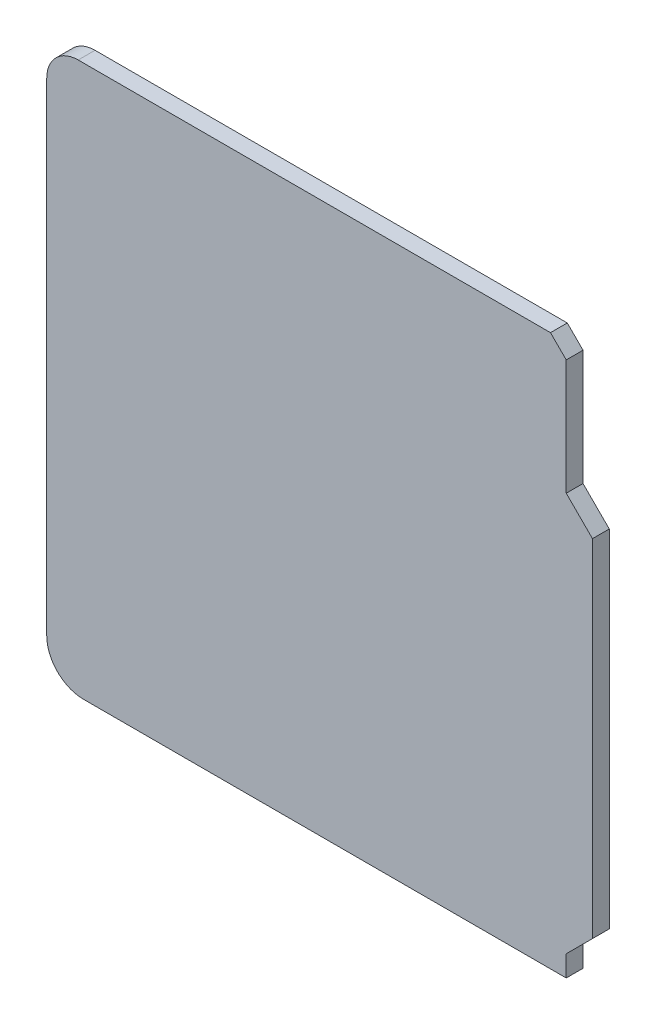
ISO-10303-21;
HEADER;
FILE_DESCRIPTION(('STEP AP214'),'2;1');
FILE_NAME('part.step','',(''),(''),'','','');
FILE_SCHEMA(('AUTOMOTIVE_DESIGN { 1 0 10303 214 1 1 1 1 }'));
ENDSEC;
DATA;
#1=APPLICATION_CONTEXT('core data for automotive mechanical design processes');
#2=APPLICATION_PROTOCOL_DEFINITION('international standard','automotive_design',2000,#1);
#3=PRODUCT_CONTEXT('',#1,'mechanical');
#4=PRODUCT('Part','Part','',(#3));
#5=PRODUCT_RELATED_PRODUCT_CATEGORY('part','',(#4));
#6=PRODUCT_DEFINITION_FORMATION('','',#4);
#7=PRODUCT_DEFINITION_CONTEXT('part definition',#1,'design');
#8=PRODUCT_DEFINITION('design','',#6,#7);
#9=PRODUCT_DEFINITION_SHAPE('','',#8);
#10=(LENGTH_UNIT() NAMED_UNIT(*) SI_UNIT(.MILLI.,.METRE.));
#11=(NAMED_UNIT(*) PLANE_ANGLE_UNIT() SI_UNIT($,.RADIAN.));
#12=(NAMED_UNIT(*) SI_UNIT($,.STERADIAN.) SOLID_ANGLE_UNIT());
#13=UNCERTAINTY_MEASURE_WITH_UNIT(LENGTH_MEASURE(1.E-05),#10,'distance_accuracy_value','');
#14=(GEOMETRIC_REPRESENTATION_CONTEXT(3) GLOBAL_UNCERTAINTY_ASSIGNED_CONTEXT((#13)) GLOBAL_UNIT_ASSIGNED_CONTEXT((#10,
#11,#12)) REPRESENTATION_CONTEXT('',''));
#15=CARTESIAN_POINT('',(0.,0.,0.));
#16=DIRECTION('',(0.,0.,1.));
#17=DIRECTION('',(1.,0.,0.));
#18=AXIS2_PLACEMENT_3D('',#15,#16,#17);
#19=CARTESIAN_POINT('',(-24.7092776223408,29.8901661766281,1.6));
#20=DIRECTION('',(0.,0.,-1.));
#21=DIRECTION('',(-1.,0.,0.));
#22=AXIS2_PLACEMENT_3D('',#19,#20,#21);
#23=CYLINDRICAL_SURFACE('',#22,3.);
#24=CARTESIAN_POINT('',(-24.7092776223408,29.8901661766281,0.));
#25=DIRECTION('',(0.,0.,1.));
#26=DIRECTION('',(1.,0.,0.));
#27=AXIS2_PLACEMENT_3D('',#24,#25,#26);
#28=CIRCLE('',#27,3.);
#29=CARTESIAN_POINT('',(-24.7092776223408,32.8901661766281,0.));
#30=VERTEX_POINT('',#29);
#31=CARTESIAN_POINT('',(-27.7092776223408,29.8901661766281,0.));
#32=VERTEX_POINT('',#31);
#33=EDGE_CURVE('E148',#30,#32,#28,.T.);
#34=ORIENTED_EDGE('',*,*,#33,.T.);
#35=DIRECTION('',(0.,0.,-1.));
#36=VECTOR('',#35,1.);
#37=CARTESIAN_POINT('',(-27.7092776223408,29.8901661766281,1.6));
#38=LINE('',#37,#36);
#39=CARTESIAN_POINT('',(-27.7092776223408,29.8901661766281,1.6));
#40=VERTEX_POINT('',#39);
#41=EDGE_CURVE('E11',#40,#32,#38,.T.);
#42=ORIENTED_EDGE('',*,*,#41,.F.);
#43=CARTESIAN_POINT('',(-24.7092776223408,29.8901661766281,1.6));
#44=DIRECTION('',(0.,0.,1.));
#45=DIRECTION('',(1.,0.,0.));
#46=AXIS2_PLACEMENT_3D('',#43,#44,#45);
#47=CIRCLE('',#46,3.);
#48=CARTESIAN_POINT('',(-24.7092776223408,32.8901661766281,1.6));
#49=VERTEX_POINT('',#48);
#50=EDGE_CURVE('E168',#49,#40,#47,.T.);
#51=ORIENTED_EDGE('',*,*,#50,.F.);
#52=DIRECTION('',(0.,0.,-1.));
#53=VECTOR('',#52,1.);
#54=CARTESIAN_POINT('',(-24.7092776223408,32.8901661766281,1.6));
#55=LINE('',#54,#53);
#56=EDGE_CURVE('E144',#49,#30,#55,.T.);
#57=ORIENTED_EDGE('',*,*,#56,.T.);
#58=EDGE_LOOP('',(#34,#42,#51,#57));
#59=FACE_BOUND('',#58,.T.);
#60=ADVANCED_FACE('F34',(#59),#23,.T.);
#61=CARTESIAN_POINT('',(-27.7092776223408,29.8901661766281,1.6));
#62=DIRECTION('',(1.,0.,0.));
#63=DIRECTION('',(0.,1.,0.));
#64=AXIS2_PLACEMENT_3D('',#61,#62,#63);
#65=PLANE('',#64);
#66=DIRECTION('',(0.,-1.,0.));
#67=VECTOR('',#66,1.);
#68=CARTESIAN_POINT('',(-27.7092776223408,29.8901661766281,0.));
#69=LINE('',#68,#67);
#70=CARTESIAN_POINT('',(-27.7092776223408,-16.1143042121438,0.));
#71=VERTEX_POINT('',#70);
#72=EDGE_CURVE('E151',#32,#71,#69,.T.);
#73=ORIENTED_EDGE('',*,*,#72,.T.);
#74=DIRECTION('',(0.,0.,-1.));
#75=VECTOR('',#74,1.);
#76=CARTESIAN_POINT('',(-27.7092776223408,-16.1143042121438,1.6));
#77=LINE('',#76,#75);
#78=CARTESIAN_POINT('',(-27.7092776223408,-16.1143042121438,1.6));
#79=VERTEX_POINT('',#78);
#80=EDGE_CURVE('E42',#79,#71,#77,.T.);
#81=ORIENTED_EDGE('',*,*,#80,.F.);
#82=DIRECTION('',(0.,-1.,0.));
#83=VECTOR('',#82,1.);
#84=CARTESIAN_POINT('',(-27.7092776223408,29.8901661766281,1.6));
#85=LINE('',#84,#83);
#86=EDGE_CURVE('E102',#40,#79,#85,.T.);
#87=ORIENTED_EDGE('',*,*,#86,.F.);
#88=ORIENTED_EDGE('',*,*,#41,.T.);
#89=EDGE_LOOP('',(#73,#81,#87,#88));
#90=FACE_BOUND('',#89,.T.);
#91=ADVANCED_FACE('F240',(#90),#65,.F.);
#92=CARTESIAN_POINT('',(-24.2092776223408,-16.1143042121438,1.6));
#93=DIRECTION('',(0.,0.,-1.));
#94=DIRECTION('',(-1.,0.,0.));
#95=AXIS2_PLACEMENT_3D('',#92,#93,#94);
#96=CYLINDRICAL_SURFACE('',#95,3.5);
#97=CARTESIAN_POINT('',(-24.2092776223408,-16.1143042121438,0.));
#98=DIRECTION('',(0.,0.,1.));
#99=DIRECTION('',(1.,0.,0.));
#100=AXIS2_PLACEMENT_3D('',#97,#98,#99);
#101=CIRCLE('',#100,3.5);
#102=CARTESIAN_POINT('',(-24.2092776223408,-19.6143042121438,0.));
#103=VERTEX_POINT('',#102);
#104=EDGE_CURVE('E153',#71,#103,#101,.T.);
#105=ORIENTED_EDGE('',*,*,#104,.T.);
#106=DIRECTION('',(0.,0.,-1.));
#107=VECTOR('',#106,1.);
#108=CARTESIAN_POINT('',(-24.2092776223408,-19.6143042121438,1.6));
#109=LINE('',#108,#107);
#110=CARTESIAN_POINT('',(-24.2092776223408,-19.6143042121438,1.6));
#111=VERTEX_POINT('',#110);
#112=EDGE_CURVE('E184',#111,#103,#109,.T.);
#113=ORIENTED_EDGE('',*,*,#112,.F.);
#114=CARTESIAN_POINT('',(-24.2092776223408,-16.1143042121438,1.6));
#115=DIRECTION('',(0.,0.,1.));
#116=DIRECTION('',(1.,0.,0.));
#117=AXIS2_PLACEMENT_3D('',#114,#115,#116);
#118=CIRCLE('',#117,3.5);
#119=EDGE_CURVE('E192',#79,#111,#118,.T.);
#120=ORIENTED_EDGE('',*,*,#119,.F.);
#121=ORIENTED_EDGE('',*,*,#80,.T.);
#122=EDGE_LOOP('',(#105,#113,#120,#121));
#123=FACE_BOUND('',#122,.T.);
#124=ADVANCED_FACE('F190',(#123),#96,.T.);
#125=CARTESIAN_POINT('',(21.7907223776592,-19.6143042121438,1.6));
#126=DIRECTION('',(0.,1.,0.));
#127=DIRECTION('',(-1.,0.,0.));
#128=AXIS2_PLACEMENT_3D('',#125,#126,#127);
#129=PLANE('',#128);
#130=DIRECTION('',(1.,0.,0.));
#131=VECTOR('',#130,1.);
#132=CARTESIAN_POINT('',(21.7907223776592,-19.6143042121438,0.));
#133=LINE('',#132,#131);
#134=CARTESIAN_POINT('',(21.7907223776592,-19.6143042121438,0.));
#135=VERTEX_POINT('',#134);
#136=EDGE_CURVE('E155',#103,#135,#133,.T.);
#137=ORIENTED_EDGE('',*,*,#136,.T.);
#138=DIRECTION('',(0.,0.,-1.));
#139=VECTOR('',#138,1.);
#140=CARTESIAN_POINT('',(21.7907223776592,-19.6143042121438,1.6));
#141=LINE('',#140,#139);
#142=CARTESIAN_POINT('',(21.7907223776592,-19.6143042121438,1.6));
#143=VERTEX_POINT('',#142);
#144=EDGE_CURVE('E181',#143,#135,#141,.T.);
#145=ORIENTED_EDGE('',*,*,#144,.F.);
#146=DIRECTION('',(1.,0.,0.));
#147=VECTOR('',#146,1.);
#148=CARTESIAN_POINT('',(21.7907223776592,-19.6143042121438,1.6));
#149=LINE('',#148,#147);
#150=EDGE_CURVE('E210',#111,#143,#149,.T.);
#151=ORIENTED_EDGE('',*,*,#150,.F.);
#152=ORIENTED_EDGE('',*,*,#112,.T.);
#153=EDGE_LOOP('',(#137,#145,#151,#152));
#154=FACE_BOUND('',#153,.T.);
#155=ADVANCED_FACE('F201',(#154),#129,.F.);
#156=CARTESIAN_POINT('',(21.7907223776592,-17.6143042121438,1.6));
#157=DIRECTION('',(-1.,0.,0.));
#158=DIRECTION('',(0.,0.,1.));
#159=AXIS2_PLACEMENT_3D('',#156,#157,#158);
#160=PLANE('',#159);
#161=DIRECTION('',(0.,1.,0.));
#162=VECTOR('',#161,1.);
#163=CARTESIAN_POINT('',(21.7907223776592,-17.6143042121438,0.));
#164=LINE('',#163,#162);
#165=CARTESIAN_POINT('',(21.7907223776592,-17.6143042121438,0.));
#166=VERTEX_POINT('',#165);
#167=EDGE_CURVE('E157',#135,#166,#164,.T.);
#168=ORIENTED_EDGE('',*,*,#167,.T.);
#169=DIRECTION('',(0.,0.,-1.));
#170=VECTOR('',#169,1.);
#171=CARTESIAN_POINT('',(21.7907223776592,-17.6143042121438,1.6));
#172=LINE('',#171,#170);
#173=CARTESIAN_POINT('',(21.7907223776592,-17.6143042121438,1.6));
#174=VERTEX_POINT('',#173);
#175=EDGE_CURVE('E178',#174,#166,#172,.T.);
#176=ORIENTED_EDGE('',*,*,#175,.F.);
#177=DIRECTION('',(0.,1.,0.));
#178=VECTOR('',#177,1.);
#179=CARTESIAN_POINT('',(21.7907223776592,-17.6143042121438,1.6));
#180=LINE('',#179,#178);
#181=EDGE_CURVE('E207',#143,#174,#180,.T.);
#182=ORIENTED_EDGE('',*,*,#181,.F.);
#183=ORIENTED_EDGE('',*,*,#144,.T.);
#184=EDGE_LOOP('',(#168,#176,#182,#183));
#185=FACE_BOUND('',#184,.T.);
#186=ADVANCED_FACE('F205',(#185),#160,.F.);
#187=CARTESIAN_POINT('',(24.2907223776592,-15.1143042121438,1.6));
#188=DIRECTION('',(-0.707106781186547,0.707106781186548,0.));
#189=DIRECTION('',(-0.707106781186548,-0.707106781186547,0.));
#190=AXIS2_PLACEMENT_3D('',#187,#188,#189);
#191=PLANE('',#190);
#192=DIRECTION('',(0.707106781186548,0.707106781186547,0.));
#193=VECTOR('',#192,1.);
#194=CARTESIAN_POINT('',(24.2907223776592,-15.1143042121438,0.));
#195=LINE('',#194,#193);
#196=CARTESIAN_POINT('',(24.2907223776592,-15.1143042121438,0.));
#197=VERTEX_POINT('',#196);
#198=EDGE_CURVE('E159',#166,#197,#195,.T.);
#199=ORIENTED_EDGE('',*,*,#198,.T.);
#200=DIRECTION('',(0.,0.,-1.));
#201=VECTOR('',#200,1.);
#202=CARTESIAN_POINT('',(24.2907223776592,-15.1143042121438,1.6));
#203=LINE('',#202,#201);
#204=CARTESIAN_POINT('',(24.2907223776592,-15.1143042121438,1.6));
#205=VERTEX_POINT('',#204);
#206=EDGE_CURVE('E175',#205,#197,#203,.T.);
#207=ORIENTED_EDGE('',*,*,#206,.F.);
#208=DIRECTION('',(0.707106781186548,0.707106781186547,0.));
#209=VECTOR('',#208,1.);
#210=CARTESIAN_POINT('',(24.2907223776592,-15.1143042121438,1.6));
#211=LINE('',#210,#209);
#212=EDGE_CURVE('E209',#174,#205,#211,.T.);
#213=ORIENTED_EDGE('',*,*,#212,.F.);
#214=ORIENTED_EDGE('',*,*,#175,.T.);
#215=EDGE_LOOP('',(#199,#207,#213,#214));
#216=FACE_BOUND('',#215,.T.);
#217=ADVANCED_FACE('F253',(#216),#191,.F.);
#218=CARTESIAN_POINT('',(24.2907223776592,17.8901661766281,1.6));
#219=DIRECTION('',(-1.,0.,0.));
#220=DIRECTION('',(0.,-1.,0.));
#221=AXIS2_PLACEMENT_3D('',#218,#219,#220);
#222=PLANE('',#221);
#223=DIRECTION('',(0.,1.,0.));
#224=VECTOR('',#223,1.);
#225=CARTESIAN_POINT('',(24.2907223776592,17.8901661766281,0.));
#226=LINE('',#225,#224);
#227=CARTESIAN_POINT('',(24.2907223776592,17.8901661766281,0.));
#228=VERTEX_POINT('',#227);
#229=EDGE_CURVE('E161',#197,#228,#226,.T.);
#230=ORIENTED_EDGE('',*,*,#229,.T.);
#231=DIRECTION('',(0.,0.,-1.));
#232=VECTOR('',#231,1.);
#233=CARTESIAN_POINT('',(24.2907223776592,17.8901661766281,1.6));
#234=LINE('',#233,#232);
#235=CARTESIAN_POINT('',(24.2907223776592,17.8901661766281,1.6));
#236=VERTEX_POINT('',#235);
#237=EDGE_CURVE('E172',#236,#228,#234,.T.);
#238=ORIENTED_EDGE('',*,*,#237,.F.);
#239=DIRECTION('',(0.,1.,0.));
#240=VECTOR('',#239,1.);
#241=CARTESIAN_POINT('',(24.2907223776592,17.8901661766281,1.6));
#242=LINE('',#241,#240);
#243=EDGE_CURVE('E212',#205,#236,#242,.T.);
#244=ORIENTED_EDGE('',*,*,#243,.F.);
#245=ORIENTED_EDGE('',*,*,#206,.T.);
#246=EDGE_LOOP('',(#230,#238,#244,#245));
#247=FACE_BOUND('',#246,.T.);
#248=ADVANCED_FACE('F221',(#247),#222,.F.);
#249=CARTESIAN_POINT('',(21.7907223776592,20.3901661766281,1.6));
#250=DIRECTION('',(-0.707106781186548,-0.707106781186548,0.));
#251=DIRECTION('',(0.707106781186548,-0.707106781186548,0.));
#252=AXIS2_PLACEMENT_3D('',#249,#250,#251);
#253=PLANE('',#252);
#254=DIRECTION('',(-0.707106781186547,0.707106781186547,0.));
#255=VECTOR('',#254,1.);
#256=CARTESIAN_POINT('',(21.7907223776592,20.3901661766281,0.));
#257=LINE('',#256,#255);
#258=CARTESIAN_POINT('',(21.7907223776592,20.3901661766281,0.));
#259=VERTEX_POINT('',#258);
#260=EDGE_CURVE('E163',#228,#259,#257,.T.);
#261=ORIENTED_EDGE('',*,*,#260,.T.);
#262=DIRECTION('',(0.,0.,-1.));
#263=VECTOR('',#262,1.);
#264=CARTESIAN_POINT('',(21.7907223776592,20.3901661766281,1.6));
#265=LINE('',#264,#263);
#266=CARTESIAN_POINT('',(21.7907223776592,20.3901661766281,1.6));
#267=VERTEX_POINT('',#266);
#268=EDGE_CURVE('E139',#267,#259,#265,.T.);
#269=ORIENTED_EDGE('',*,*,#268,.F.);
#270=DIRECTION('',(-0.707106781186547,0.707106781186547,0.));
#271=VECTOR('',#270,1.);
#272=CARTESIAN_POINT('',(21.7907223776592,20.3901661766281,1.6));
#273=LINE('',#272,#271);
#274=EDGE_CURVE('E130',#236,#267,#273,.T.);
#275=ORIENTED_EDGE('',*,*,#274,.F.);
#276=ORIENTED_EDGE('',*,*,#237,.T.);
#277=EDGE_LOOP('',(#261,#269,#275,#276));
#278=FACE_BOUND('',#277,.T.);
#279=ADVANCED_FACE('F225',(#278),#253,.F.);
#280=CARTESIAN_POINT('',(21.7907223776592,31.3901661766281,1.6));
#281=DIRECTION('',(-1.,0.,0.));
#282=DIRECTION('',(0.,0.,1.));
#283=AXIS2_PLACEMENT_3D('',#280,#281,#282);
#284=PLANE('',#283);
#285=DIRECTION('',(0.,1.,0.));
#286=VECTOR('',#285,1.);
#287=CARTESIAN_POINT('',(21.7907223776592,31.3901661766281,0.));
#288=LINE('',#287,#286);
#289=CARTESIAN_POINT('',(21.7907223776592,31.3901661766281,0.));
#290=VERTEX_POINT('',#289);
#291=EDGE_CURVE('E138',#259,#290,#288,.T.);
#292=ORIENTED_EDGE('',*,*,#291,.T.);
#293=DIRECTION('',(0.,0.,-1.));
#294=VECTOR('',#293,1.);
#295=CARTESIAN_POINT('',(21.7907223776592,31.3901661766281,1.6));
#296=LINE('',#295,#294);
#297=CARTESIAN_POINT('',(21.7907223776592,31.3901661766281,1.6));
#298=VERTEX_POINT('',#297);
#299=EDGE_CURVE('E135',#298,#290,#296,.T.);
#300=ORIENTED_EDGE('',*,*,#299,.F.);
#301=DIRECTION('',(0.,1.,0.));
#302=VECTOR('',#301,1.);
#303=CARTESIAN_POINT('',(21.7907223776592,31.3901661766281,1.6));
#304=LINE('',#303,#302);
#305=EDGE_CURVE('E124',#267,#298,#304,.T.);
#306=ORIENTED_EDGE('',*,*,#305,.F.);
#307=ORIENTED_EDGE('',*,*,#268,.T.);
#308=EDGE_LOOP('',(#292,#300,#306,#307));
#309=FACE_BOUND('',#308,.T.);
#310=ADVANCED_FACE('F136',(#309),#284,.F.);
#311=CARTESIAN_POINT('',(20.2907223776592,32.8901661766281,1.6));
#312=DIRECTION('',(-0.707106781186548,-0.707106781186548,0.));
#313=DIRECTION('',(0.707106781186548,-0.707106781186548,0.));
#314=AXIS2_PLACEMENT_3D('',#311,#312,#313);
#315=PLANE('',#314);
#316=DIRECTION('',(-0.707106781186547,0.707106781186547,0.));
#317=VECTOR('',#316,1.);
#318=CARTESIAN_POINT('',(20.2907223776592,32.8901661766281,0.));
#319=LINE('',#318,#317);
#320=CARTESIAN_POINT('',(20.2907223776592,32.8901661766281,0.));
#321=VERTEX_POINT('',#320);
#322=EDGE_CURVE('E88',#290,#321,#319,.T.);
#323=ORIENTED_EDGE('',*,*,#322,.T.);
#324=DIRECTION('',(0.,0.,-1.));
#325=VECTOR('',#324,1.);
#326=CARTESIAN_POINT('',(20.2907223776592,32.8901661766281,1.6));
#327=LINE('',#326,#325);
#328=CARTESIAN_POINT('',(20.2907223776592,32.8901661766281,1.6));
#329=VERTEX_POINT('',#328);
#330=EDGE_CURVE('E140',#329,#321,#327,.T.);
#331=ORIENTED_EDGE('',*,*,#330,.F.);
#332=DIRECTION('',(-0.707106781186547,0.707106781186547,0.));
#333=VECTOR('',#332,1.);
#334=CARTESIAN_POINT('',(20.2907223776592,32.8901661766281,1.6));
#335=LINE('',#334,#333);
#336=EDGE_CURVE('E128',#298,#329,#335,.T.);
#337=ORIENTED_EDGE('',*,*,#336,.F.);
#338=ORIENTED_EDGE('',*,*,#299,.T.);
#339=EDGE_LOOP('',(#323,#331,#337,#338));
#340=FACE_BOUND('',#339,.T.);
#341=ADVANCED_FACE('F142',(#340),#315,.F.);
#342=CARTESIAN_POINT('',(-24.7092776223408,32.8901661766281,1.6));
#343=DIRECTION('',(0.,-1.,0.));
#344=DIRECTION('',(0.,0.,-1.));
#345=AXIS2_PLACEMENT_3D('',#342,#343,#344);
#346=PLANE('',#345);
#347=DIRECTION('',(-1.,0.,0.));
#348=VECTOR('',#347,1.);
#349=CARTESIAN_POINT('',(-24.7092776223408,32.8901661766281,0.));
#350=LINE('',#349,#348);
#351=EDGE_CURVE('E94',#321,#30,#350,.T.);
#352=ORIENTED_EDGE('',*,*,#351,.T.);
#353=ORIENTED_EDGE('',*,*,#56,.F.);
#354=DIRECTION('',(-1.,0.,0.));
#355=VECTOR('',#354,1.);
#356=CARTESIAN_POINT('',(-24.7092776223408,32.8901661766281,1.6));
#357=LINE('',#356,#355);
#358=EDGE_CURVE('E50',#329,#49,#357,.T.);
#359=ORIENTED_EDGE('',*,*,#358,.F.);
#360=ORIENTED_EDGE('',*,*,#330,.T.);
#361=EDGE_LOOP('',(#352,#353,#359,#360));
#362=FACE_BOUND('',#361,.T.);
#363=ADVANCED_FACE('F229',(#362),#346,.F.);
#364=CARTESIAN_POINT('',(-24.7092776223408,29.8901661766281,1.6));
#365=DIRECTION('',(0.,0.,1.));
#366=DIRECTION('',(1.,0.,0.));
#367=AXIS2_PLACEMENT_3D('',#364,#365,#366);
#368=PLANE('',#367);
#369=ORIENTED_EDGE('',*,*,#50,.T.);
#370=ORIENTED_EDGE('',*,*,#86,.T.);
#371=ORIENTED_EDGE('',*,*,#119,.T.);
#372=ORIENTED_EDGE('',*,*,#150,.T.);
#373=ORIENTED_EDGE('',*,*,#181,.T.);
#374=ORIENTED_EDGE('',*,*,#212,.T.);
#375=ORIENTED_EDGE('',*,*,#243,.T.);
#376=ORIENTED_EDGE('',*,*,#274,.T.);
#377=ORIENTED_EDGE('',*,*,#305,.T.);
#378=ORIENTED_EDGE('',*,*,#336,.T.);
#379=ORIENTED_EDGE('',*,*,#358,.T.);
#380=EDGE_LOOP('',(#369,#370,#371,#372,#373,#374,#375,#376,#377,#378,#379));
#381=FACE_BOUND('',#380,.T.);
#382=ADVANCED_FACE('F126',(#381),#368,.T.);
#383=CARTESIAN_POINT('',(-24.7092776223408,29.8901661766281,0.));
#384=DIRECTION('',(0.,0.,1.));
#385=DIRECTION('',(1.,0.,0.));
#386=AXIS2_PLACEMENT_3D('',#383,#384,#385);
#387=PLANE('',#386);
#388=ORIENTED_EDGE('',*,*,#33,.F.);
#389=ORIENTED_EDGE('',*,*,#351,.F.);
#390=ORIENTED_EDGE('',*,*,#322,.F.);
#391=ORIENTED_EDGE('',*,*,#291,.F.);
#392=ORIENTED_EDGE('',*,*,#260,.F.);
#393=ORIENTED_EDGE('',*,*,#229,.F.);
#394=ORIENTED_EDGE('',*,*,#198,.F.);
#395=ORIENTED_EDGE('',*,*,#167,.F.);
#396=ORIENTED_EDGE('',*,*,#136,.F.);
#397=ORIENTED_EDGE('',*,*,#104,.F.);
#398=ORIENTED_EDGE('',*,*,#72,.F.);
#399=EDGE_LOOP('',(#388,#389,#390,#391,#392,#393,#394,#395,#396,#397,#398));
#400=FACE_BOUND('',#399,.T.);
#401=ADVANCED_FACE('F196',(#400),#387,.F.);
#402=CLOSED_SHELL('',(#60,#91,#124,#155,#186,#217,#248,#279,#310,#341,#363,#382,#401));
#403=MANIFOLD_SOLID_BREP('B2',#402);
#404=ADVANCED_BREP_SHAPE_REPRESENTATION('',(#18,#403),#14);
#405=SHAPE_DEFINITION_REPRESENTATION(#9,#404);
ENDSEC;
END-ISO-10303-21;
